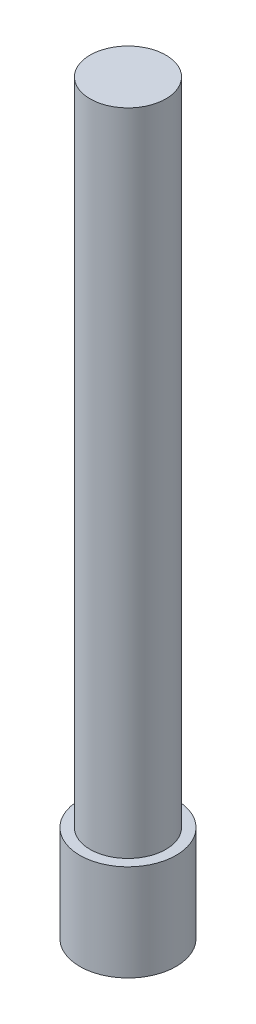
ISO-10303-21;
HEADER;
FILE_DESCRIPTION(('STEP AP214'),'2;1');
FILE_NAME('part.step','',(''),(''),'','','');
FILE_SCHEMA(('AUTOMOTIVE_DESIGN { 1 0 10303 214 1 1 1 1 }'));
ENDSEC;
DATA;
#1=APPLICATION_CONTEXT('core data for automotive mechanical design processes');
#2=APPLICATION_PROTOCOL_DEFINITION('international standard','automotive_design',2000,#1);
#3=PRODUCT_CONTEXT('',#1,'mechanical');
#4=PRODUCT('Part','Part','',(#3));
#5=PRODUCT_RELATED_PRODUCT_CATEGORY('part','',(#4));
#6=PRODUCT_DEFINITION_FORMATION('','',#4);
#7=PRODUCT_DEFINITION_CONTEXT('part definition',#1,'design');
#8=PRODUCT_DEFINITION('design','',#6,#7);
#9=PRODUCT_DEFINITION_SHAPE('','',#8);
#10=(LENGTH_UNIT() NAMED_UNIT(*) SI_UNIT(.MILLI.,.METRE.));
#11=(NAMED_UNIT(*) PLANE_ANGLE_UNIT() SI_UNIT($,.RADIAN.));
#12=(NAMED_UNIT(*) SI_UNIT($,.STERADIAN.) SOLID_ANGLE_UNIT());
#13=UNCERTAINTY_MEASURE_WITH_UNIT(LENGTH_MEASURE(1.E-05),#10,'distance_accuracy_value','');
#14=(GEOMETRIC_REPRESENTATION_CONTEXT(3) GLOBAL_UNCERTAINTY_ASSIGNED_CONTEXT((#13)) GLOBAL_UNIT_ASSIGNED_CONTEXT((#10,
#11,#12)) REPRESENTATION_CONTEXT('',''));
#15=CARTESIAN_POINT('',(0.,0.,0.));
#16=DIRECTION('',(0.,0.,1.));
#17=DIRECTION('',(1.,0.,0.));
#18=AXIS2_PLACEMENT_3D('',#15,#16,#17);
#19=CARTESIAN_POINT('',(0.,0.,0.));
#20=DIRECTION('',(0.,1.,0.));
#21=DIRECTION('',(0.,0.,1.));
#22=AXIS2_PLACEMENT_3D('',#19,#20,#21);
#23=PLANE('',#22);
#24=CARTESIAN_POINT('',(0.,0.,0.));
#25=DIRECTION('',(0.,1.,0.));
#26=DIRECTION('',(0.,0.,1.));
#27=AXIS2_PLACEMENT_3D('',#24,#25,#26);
#28=CIRCLE('',#27,2.);
#29=CARTESIAN_POINT('',(0.,0.,2.));
#30=VERTEX_POINT('',#29);
#31=EDGE_CURVE('E41',#30,#30,#28,.T.);
#32=ORIENTED_EDGE('',*,*,#31,.F.);
#33=EDGE_LOOP('',(#32));
#34=FACE_BOUND('',#33,.T.);
#35=CARTESIAN_POINT('',(0.,0.,0.));
#36=DIRECTION('',(0.,1.,0.));
#37=DIRECTION('',(0.,0.,1.));
#38=AXIS2_PLACEMENT_3D('',#35,#36,#37);
#39=CIRCLE('',#38,1.025);
#40=CARTESIAN_POINT('',(0.,0.,1.025));
#41=VERTEX_POINT('',#40);
#42=EDGE_CURVE('E51',#41,#41,#39,.T.);
#43=ORIENTED_EDGE('',*,*,#42,.T.);
#44=EDGE_LOOP('',(#43));
#45=FACE_BOUND('',#44,.T.);
#46=ADVANCED_FACE('F37',(#34,#45),#23,.F.);
#47=CARTESIAN_POINT('',(0.,3.,0.));
#48=DIRECTION('',(0.,-1.,0.));
#49=DIRECTION('',(0.,0.,-1.));
#50=AXIS2_PLACEMENT_3D('',#47,#48,#49);
#51=CYLINDRICAL_SURFACE('',#50,2.);
#52=ORIENTED_EDGE('',*,*,#31,.T.);
#53=EDGE_LOOP('',(#52));
#54=FACE_BOUND('',#53,.T.);
#55=CARTESIAN_POINT('',(0.,4.,0.));
#56=DIRECTION('',(0.,1.,0.));
#57=DIRECTION('',(0.,0.,1.));
#58=AXIS2_PLACEMENT_3D('',#55,#56,#57);
#59=CIRCLE('',#58,2.);
#60=CARTESIAN_POINT('',(0.,4.,2.));
#61=VERTEX_POINT('',#60);
#62=EDGE_CURVE('E55',#61,#61,#59,.T.);
#63=ORIENTED_EDGE('',*,*,#62,.F.);
#64=EDGE_LOOP('',(#63));
#65=FACE_BOUND('',#64,.T.);
#66=ADVANCED_FACE('F39',(#54,#65),#51,.T.);
#67=CARTESIAN_POINT('',(0.,3.,0.));
#68=DIRECTION('',(0.,-1.,0.));
#69=DIRECTION('',(0.,0.,-1.));
#70=AXIS2_PLACEMENT_3D('',#67,#68,#69);
#71=CYLINDRICAL_SURFACE('',#70,1.025);
#72=CARTESIAN_POINT('',(0.,3.,0.));
#73=DIRECTION('',(0.,1.,0.));
#74=DIRECTION('',(0.,0.,1.));
#75=AXIS2_PLACEMENT_3D('',#72,#73,#74);
#76=CIRCLE('',#75,1.025);
#77=CARTESIAN_POINT('',(0.,3.,1.025));
#78=VERTEX_POINT('',#77);
#79=EDGE_CURVE('E59',#78,#78,#76,.T.);
#80=ORIENTED_EDGE('',*,*,#79,.T.);
#81=EDGE_LOOP('',(#80));
#82=FACE_BOUND('',#81,.T.);
#83=ORIENTED_EDGE('',*,*,#42,.F.);
#84=EDGE_LOOP('',(#83));
#85=FACE_BOUND('',#84,.T.);
#86=ADVANCED_FACE('F67',(#82,#85),#71,.F.);
#87=CARTESIAN_POINT('',(0.,3.,0.));
#88=DIRECTION('',(0.,1.,0.));
#89=DIRECTION('',(0.,0.,1.));
#90=AXIS2_PLACEMENT_3D('',#87,#88,#89);
#91=PLANE('',#90);
#92=ORIENTED_EDGE('',*,*,#79,.F.);
#93=EDGE_LOOP('',(#92));
#94=FACE_BOUND('',#93,.T.);
#95=ADVANCED_FACE('F69',(#94),#91,.F.);
#96=CARTESIAN_POINT('',(0.,4.,0.));
#97=DIRECTION('',(0.,1.,0.));
#98=DIRECTION('',(0.,0.,1.));
#99=AXIS2_PLACEMENT_3D('',#96,#97,#98);
#100=PLANE('',#99);
#101=CARTESIAN_POINT('',(0.,4.,0.));
#102=DIRECTION('',(0.,1.,0.));
#103=DIRECTION('',(0.,0.,1.));
#104=AXIS2_PLACEMENT_3D('',#101,#102,#103);
#105=CIRCLE('',#104,1.575);
#106=CARTESIAN_POINT('',(0.,4.,1.575));
#107=VERTEX_POINT('',#106);
#108=EDGE_CURVE('E10',#107,#107,#105,.T.);
#109=ORIENTED_EDGE('',*,*,#108,.F.);
#110=EDGE_LOOP('',(#109));
#111=FACE_BOUND('',#110,.T.);
#112=ORIENTED_EDGE('',*,*,#62,.T.);
#113=EDGE_LOOP('',(#112));
#114=FACE_BOUND('',#113,.T.);
#115=ADVANCED_FACE('F76',(#111,#114),#100,.T.);
#116=CARTESIAN_POINT('',(0.,31.,0.));
#117=DIRECTION('',(0.,-1.,0.));
#118=DIRECTION('',(0.,0.,-1.));
#119=AXIS2_PLACEMENT_3D('',#116,#117,#118);
#120=CYLINDRICAL_SURFACE('',#119,1.575);
#121=CARTESIAN_POINT('',(0.,31.,0.));
#122=DIRECTION('',(0.,1.,0.));
#123=DIRECTION('',(0.,0.,1.));
#124=AXIS2_PLACEMENT_3D('',#121,#122,#123);
#125=CIRCLE('',#124,1.575);
#126=CARTESIAN_POINT('',(0.,31.,1.575));
#127=VERTEX_POINT('',#126);
#128=EDGE_CURVE('E54',#127,#127,#125,.T.);
#129=ORIENTED_EDGE('',*,*,#128,.F.);
#130=EDGE_LOOP('',(#129));
#131=FACE_BOUND('',#130,.T.);
#132=ORIENTED_EDGE('',*,*,#108,.T.);
#133=EDGE_LOOP('',(#132));
#134=FACE_BOUND('',#133,.T.);
#135=ADVANCED_FACE('F89',(#131,#134),#120,.T.);
#136=CARTESIAN_POINT('',(0.,31.,0.));
#137=DIRECTION('',(0.,1.,0.));
#138=DIRECTION('',(0.,0.,1.));
#139=AXIS2_PLACEMENT_3D('',#136,#137,#138);
#140=PLANE('',#139);
#141=ORIENTED_EDGE('',*,*,#128,.T.);
#142=EDGE_LOOP('',(#141));
#143=FACE_BOUND('',#142,.T.);
#144=ADVANCED_FACE('F95',(#143),#140,.T.);
#145=CLOSED_SHELL('',(#46,#66,#86,#95,#115,#135,#144));
#146=MANIFOLD_SOLID_BREP('B2',#145);
#147=ADVANCED_BREP_SHAPE_REPRESENTATION('',(#18,#146),#14);
#148=SHAPE_DEFINITION_REPRESENTATION(#9,#147);
ENDSEC;
END-ISO-10303-21;
